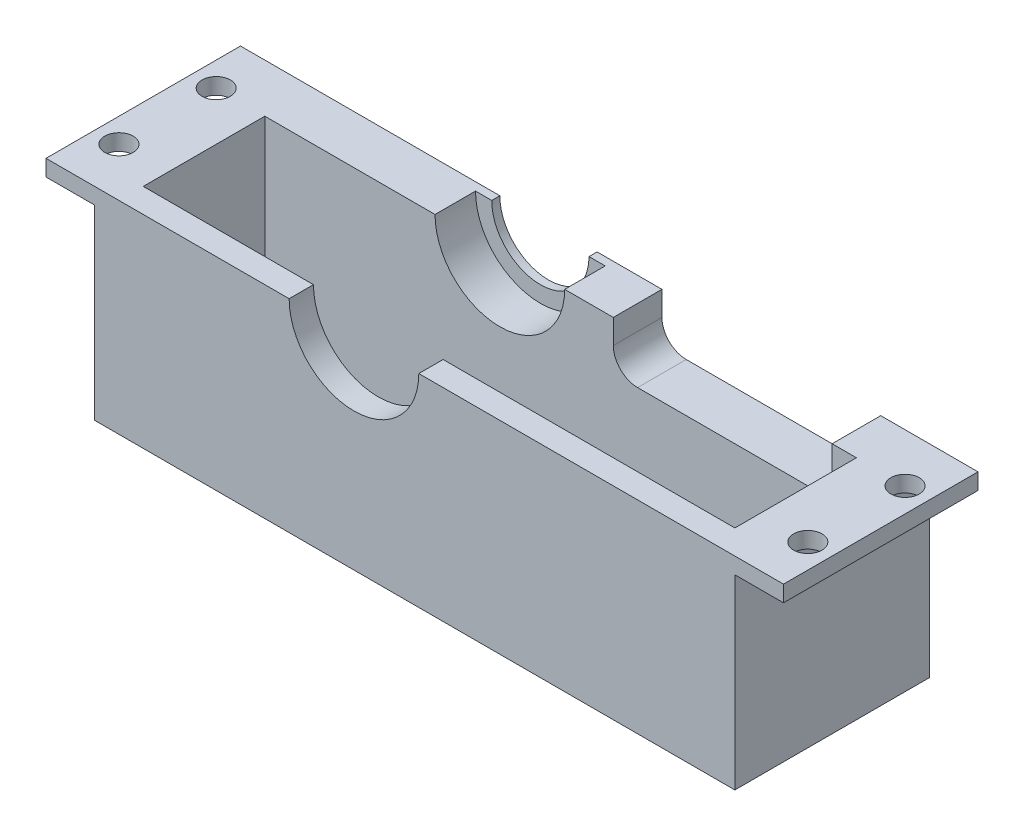
ISO-10303-21;
HEADER;
FILE_DESCRIPTION(('STEP AP214'),'2;1');
FILE_NAME('part.step','',(''),(''),'','','');
FILE_SCHEMA(('AUTOMOTIVE_DESIGN { 1 0 10303 214 1 1 1 1 }'));
ENDSEC;
DATA;
#1=APPLICATION_CONTEXT('core data for automotive mechanical design processes');
#2=APPLICATION_PROTOCOL_DEFINITION('international standard','automotive_design',2000,#1);
#3=PRODUCT_CONTEXT('',#1,'mechanical');
#4=PRODUCT('Part','Part','',(#3));
#5=PRODUCT_RELATED_PRODUCT_CATEGORY('part','',(#4));
#6=PRODUCT_DEFINITION_FORMATION('','',#4);
#7=PRODUCT_DEFINITION_CONTEXT('part definition',#1,'design');
#8=PRODUCT_DEFINITION('design','',#6,#7);
#9=PRODUCT_DEFINITION_SHAPE('','',#8);
#10=(LENGTH_UNIT() NAMED_UNIT(*) SI_UNIT(.MILLI.,.METRE.));
#11=(NAMED_UNIT(*) PLANE_ANGLE_UNIT() SI_UNIT($,.RADIAN.));
#12=(NAMED_UNIT(*) SI_UNIT($,.STERADIAN.) SOLID_ANGLE_UNIT());
#13=UNCERTAINTY_MEASURE_WITH_UNIT(LENGTH_MEASURE(1.E-05),#10,'distance_accuracy_value','');
#14=(GEOMETRIC_REPRESENTATION_CONTEXT(3) GLOBAL_UNCERTAINTY_ASSIGNED_CONTEXT((#13)) GLOBAL_UNIT_ASSIGNED_CONTEXT((#10,
#11,#12)) REPRESENTATION_CONTEXT('',''));
#15=CARTESIAN_POINT('',(0.,0.,0.));
#16=DIRECTION('',(0.,0.,1.));
#17=DIRECTION('',(1.,0.,0.));
#18=AXIS2_PLACEMENT_3D('',#15,#16,#17);
#19=CARTESIAN_POINT('',(0.,0.,0.));
#20=DIRECTION('',(0.,0.,1.));
#21=DIRECTION('',(1.,0.,0.));
#22=AXIS2_PLACEMENT_3D('',#19,#20,#21);
#23=PLANE('',#22);
#24=DIRECTION('',(0.,1.,0.));
#25=VECTOR('',#24,1.);
#26=CARTESIAN_POINT('',(9.,0.,0.));
#27=LINE('',#26,#25);
#28=CARTESIAN_POINT('',(9.,0.,0.));
#29=VERTEX_POINT('',#28);
#30=CARTESIAN_POINT('',(9.,2.,0.));
#31=VERTEX_POINT('',#30);
#32=EDGE_CURVE('E321',#29,#31,#27,.T.);
#33=ORIENTED_EDGE('',*,*,#32,.T.);
#34=DIRECTION('',(-1.,0.,0.));
#35=VECTOR('',#34,1.);
#36=CARTESIAN_POINT('',(0.,2.,0.));
#37=LINE('',#36,#35);
#38=CARTESIAN_POINT('',(3.,2.,0.));
#39=VERTEX_POINT('',#38);
#40=EDGE_CURVE('E327',#31,#39,#37,.T.);
#41=ORIENTED_EDGE('',*,*,#40,.T.);
#42=DIRECTION('',(0.,-1.,0.));
#43=VECTOR('',#42,1.);
#44=CARTESIAN_POINT('',(3.,25.,0.));
#45=LINE('',#44,#43);
#46=CARTESIAN_POINT('',(3.,25.,0.));
#47=VERTEX_POINT('',#46);
#48=EDGE_CURVE('E389',#47,#39,#45,.T.);
#49=ORIENTED_EDGE('',*,*,#48,.F.);
#50=DIRECTION('',(1.,0.,0.));
#51=VECTOR('',#50,1.);
#52=CARTESIAN_POINT('',(0.,25.,0.));
#53=LINE('',#52,#51);
#54=CARTESIAN_POINT('',(24.,25.,0.));
#55=VERTEX_POINT('',#54);
#56=EDGE_CURVE('E420',#47,#55,#53,.T.);
#57=ORIENTED_EDGE('',*,*,#56,.T.);
#58=CARTESIAN_POINT('',(32.,25.,0.));
#59=DIRECTION('',(0.,0.,1.));
#60=DIRECTION('',(1.,0.,0.));
#61=AXIS2_PLACEMENT_3D('',#58,#59,#60);
#62=CIRCLE('',#61,8.);
#63=CARTESIAN_POINT('',(40.,25.,0.));
#64=VERTEX_POINT('',#63);
#65=EDGE_CURVE('E401',#55,#64,#62,.T.);
#66=ORIENTED_EDGE('',*,*,#65,.T.);
#67=DIRECTION('',(-1.,0.,0.));
#68=VECTOR('',#67,1.);
#69=CARTESIAN_POINT('',(0.,25.,0.));
#70=LINE('',#69,#68);
#71=CARTESIAN_POINT('',(76.,25.,0.));
#72=VERTEX_POINT('',#71);
#73=EDGE_CURVE('E406',#72,#64,#70,.T.);
#74=ORIENTED_EDGE('',*,*,#73,.F.);
#75=DIRECTION('',(0.,1.,0.));
#76=VECTOR('',#75,1.);
#77=CARTESIAN_POINT('',(76.,25.,0.));
#78=LINE('',#77,#76);
#79=CARTESIAN_POINT('',(76.,2.,0.));
#80=VERTEX_POINT('',#79);
#81=EDGE_CURVE('E392',#80,#72,#78,.T.);
#82=ORIENTED_EDGE('',*,*,#81,.F.);
#83=DIRECTION('',(-1.,0.,0.));
#84=VECTOR('',#83,1.);
#85=CARTESIAN_POINT('',(0.,2.,0.));
#86=LINE('',#85,#84);
#87=CARTESIAN_POINT('',(70.,2.,0.));
#88=VERTEX_POINT('',#87);
#89=EDGE_CURVE('E348',#80,#88,#86,.T.);
#90=ORIENTED_EDGE('',*,*,#89,.T.);
#91=DIRECTION('',(0.,-1.,0.));
#92=VECTOR('',#91,1.);
#93=CARTESIAN_POINT('',(70.,0.,0.));
#94=LINE('',#93,#92);
#95=CARTESIAN_POINT('',(70.,0.,0.));
#96=VERTEX_POINT('',#95);
#97=EDGE_CURVE('E342',#88,#96,#94,.T.);
#98=ORIENTED_EDGE('',*,*,#97,.T.);
#99=DIRECTION('',(-1.,0.,0.));
#100=VECTOR('',#99,1.);
#101=CARTESIAN_POINT('',(0.,0.,0.));
#102=LINE('',#101,#100);
#103=EDGE_CURVE('E422',#96,#29,#102,.T.);
#104=ORIENTED_EDGE('',*,*,#103,.T.);
#105=EDGE_LOOP('',(#33,#41,#49,#57,#66,#74,#82,#90,#98,#104));
#106=FACE_BOUND('',#105,.T.);
#107=ADVANCED_FACE('F38',(#106),#23,.F.);
#108=CARTESIAN_POINT('',(32.,25.,3.));
#109=DIRECTION('',(0.,0.,-1.));
#110=DIRECTION('',(-1.,0.,0.));
#111=AXIS2_PLACEMENT_3D('',#108,#109,#110);
#112=CYLINDRICAL_SURFACE('',#111,8.);
#113=ORIENTED_EDGE('',*,*,#65,.F.);
#114=DIRECTION('',(0.,0.,-1.));
#115=VECTOR('',#114,1.);
#116=CARTESIAN_POINT('',(24.,25.,3.));
#117=LINE('',#116,#115);
#118=CARTESIAN_POINT('',(24.,25.,3.));
#119=VERTEX_POINT('',#118);
#120=EDGE_CURVE('E433',#119,#55,#117,.T.);
#121=ORIENTED_EDGE('',*,*,#120,.F.);
#122=CARTESIAN_POINT('',(32.,25.,3.));
#123=DIRECTION('',(0.,0.,1.));
#124=DIRECTION('',(1.,0.,0.));
#125=AXIS2_PLACEMENT_3D('',#122,#123,#124);
#126=CIRCLE('',#125,8.);
#127=CARTESIAN_POINT('',(40.,25.,3.));
#128=VERTEX_POINT('',#127);
#129=EDGE_CURVE('E402',#119,#128,#126,.T.);
#130=ORIENTED_EDGE('',*,*,#129,.T.);
#131=DIRECTION('',(0.,0.,-1.));
#132=VECTOR('',#131,1.);
#133=CARTESIAN_POINT('',(40.,25.,3.));
#134=LINE('',#133,#132);
#135=EDGE_CURVE('E417',#128,#64,#134,.T.);
#136=ORIENTED_EDGE('',*,*,#135,.T.);
#137=EDGE_LOOP('',(#113,#121,#130,#136));
#138=FACE_BOUND('',#137,.T.);
#139=ADVANCED_FACE('F526',(#138),#112,.F.);
#140=CARTESIAN_POINT('',(0.,25.,3.));
#141=DIRECTION('',(0.,1.,0.));
#142=DIRECTION('',(-1.,0.,0.));
#143=AXIS2_PLACEMENT_3D('',#140,#141,#142);
#144=PLANE('',#143);
#145=CARTESIAN_POINT('',(-2.99999999999999,25.,-3.));
#146=DIRECTION('',(0.,1.,0.));
#147=DIRECTION('',(0.,0.,-1.));
#148=AXIS2_PLACEMENT_3D('',#145,#146,#147);
#149=CIRCLE('',#148,1.74999999999998);
#150=CARTESIAN_POINT('',(-2.99999999999999,25.,-4.74999999999998));
#151=VERTEX_POINT('',#150);
#152=EDGE_CURVE('E1070',#151,#151,#149,.T.);
#153=ORIENTED_EDGE('',*,*,#152,.F.);
#154=EDGE_LOOP('',(#153));
#155=FACE_BOUND('',#154,.T.);
#156=CARTESIAN_POINT('',(-2.99999999999999,25.,-15.));
#157=DIRECTION('',(0.,1.,0.));
#158=DIRECTION('',(0.,0.,-1.));
#159=AXIS2_PLACEMENT_3D('',#156,#157,#158);
#160=CIRCLE('',#159,1.74999999999998);
#161=CARTESIAN_POINT('',(-2.99999999999999,25.,-16.75));
#162=VERTEX_POINT('',#161);
#163=EDGE_CURVE('E1067',#162,#162,#160,.T.);
#164=ORIENTED_EDGE('',*,*,#163,.F.);
#165=EDGE_LOOP('',(#164));
#166=FACE_BOUND('',#165,.T.);
#167=ORIENTED_EDGE('',*,*,#56,.F.);
#168=DIRECTION('',(0.,0.,1.));
#169=VECTOR('',#168,1.);
#170=CARTESIAN_POINT('',(3.,25.,-15.));
#171=LINE('',#170,#169);
#172=CARTESIAN_POINT('',(3.,25.,-15.));
#173=VERTEX_POINT('',#172);
#174=EDGE_CURVE('E385',#173,#47,#171,.T.);
#175=ORIENTED_EDGE('',*,*,#174,.F.);
#176=DIRECTION('',(1.,0.,0.));
#177=VECTOR('',#176,1.);
#178=CARTESIAN_POINT('',(0.,25.,-15.));
#179=LINE('',#178,#177);
#180=CARTESIAN_POINT('',(24.,25.,-15.));
#181=VERTEX_POINT('',#180);
#182=EDGE_CURVE('E362',#173,#181,#179,.T.);
#183=ORIENTED_EDGE('',*,*,#182,.T.);
#184=DIRECTION('',(0.,0.,1.));
#185=VECTOR('',#184,1.);
#186=CARTESIAN_POINT('',(24.,25.,-20.));
#187=LINE('',#186,#185);
#188=CARTESIAN_POINT('',(24.,25.,-20.));
#189=VERTEX_POINT('',#188);
#190=EDGE_CURVE('E382',#189,#181,#187,.T.);
#191=ORIENTED_EDGE('',*,*,#190,.F.);
#192=DIRECTION('',(1.,0.,0.));
#193=VECTOR('',#192,1.);
#194=CARTESIAN_POINT('',(0.,25.,-20.));
#195=LINE('',#194,#193);
#196=CARTESIAN_POINT('',(26.,25.,-20.));
#197=VERTEX_POINT('',#196);
#198=EDGE_CURVE('E274',#189,#197,#195,.T.);
#199=ORIENTED_EDGE('',*,*,#198,.T.);
#200=DIRECTION('',(0.,0.,1.));
#201=VECTOR('',#200,1.);
#202=CARTESIAN_POINT('',(26.,25.,-21.));
#203=LINE('',#202,#201);
#204=CARTESIAN_POINT('',(26.,25.,-21.));
#205=VERTEX_POINT('',#204);
#206=EDGE_CURVE('E306',#205,#197,#203,.T.);
#207=ORIENTED_EDGE('',*,*,#206,.F.);
#208=DIRECTION('',(1.,0.,0.));
#209=VECTOR('',#208,1.);
#210=CARTESIAN_POINT('',(0.,25.,-21.));
#211=LINE('',#210,#209);
#212=CARTESIAN_POINT('',(-6.,25.,-21.));
#213=VERTEX_POINT('',#212);
#214=EDGE_CURVE('E279',#213,#205,#211,.T.);
#215=ORIENTED_EDGE('',*,*,#214,.F.);
#216=DIRECTION('',(0.,0.,-1.));
#217=VECTOR('',#216,1.);
#218=CARTESIAN_POINT('',(-6.,25.,-21.));
#219=LINE('',#218,#217);
#220=CARTESIAN_POINT('',(-6.,25.,3.));
#221=VERTEX_POINT('',#220);
#222=EDGE_CURVE('E241',#221,#213,#219,.T.);
#223=ORIENTED_EDGE('',*,*,#222,.F.);
#224=DIRECTION('',(1.,0.,0.));
#225=VECTOR('',#224,1.);
#226=CARTESIAN_POINT('',(0.,25.,3.));
#227=LINE('',#226,#225);
#228=EDGE_CURVE('E405',#221,#119,#227,.T.);
#229=ORIENTED_EDGE('',*,*,#228,.T.);
#230=ORIENTED_EDGE('',*,*,#120,.T.);
#231=EDGE_LOOP('',(#167,#175,#183,#191,#199,#207,#215,#223,#229,#230));
#232=FACE_BOUND('',#231,.T.);
#233=ADVANCED_FACE('F509',(#155,#166,#232),#144,.T.);
#234=CARTESIAN_POINT('',(0.,0.,3.));
#235=DIRECTION('',(-1.,0.,0.));
#236=DIRECTION('',(0.,0.,1.));
#237=AXIS2_PLACEMENT_3D('',#234,#235,#236);
#238=PLANE('',#237);
#239=DIRECTION('',(0.,0.,1.));
#240=VECTOR('',#239,1.);
#241=CARTESIAN_POINT('',(0.,23.,-21.));
#242=LINE('',#241,#240);
#243=CARTESIAN_POINT('',(0.,23.,-21.));
#244=VERTEX_POINT('',#243);
#245=CARTESIAN_POINT('',(0.,23.,3.));
#246=VERTEX_POINT('',#245);
#247=EDGE_CURVE('E243',#244,#246,#242,.T.);
#248=ORIENTED_EDGE('',*,*,#247,.F.);
#249=DIRECTION('',(0.,1.,0.));
#250=VECTOR('',#249,1.);
#251=CARTESIAN_POINT('',(0.,0.,-21.));
#252=LINE('',#251,#250);
#253=CARTESIAN_POINT('',(0.,0.,-21.));
#254=VERTEX_POINT('',#253);
#255=EDGE_CURVE('E249',#254,#244,#252,.T.);
#256=ORIENTED_EDGE('',*,*,#255,.F.);
#257=DIRECTION('',(0.,0.,-1.));
#258=VECTOR('',#257,1.);
#259=CARTESIAN_POINT('',(0.,0.,3.));
#260=LINE('',#259,#258);
#261=CARTESIAN_POINT('',(0.,0.,3.));
#262=VERTEX_POINT('',#261);
#263=EDGE_CURVE('E431',#262,#254,#260,.T.);
#264=ORIENTED_EDGE('',*,*,#263,.F.);
#265=DIRECTION('',(0.,1.,0.));
#266=VECTOR('',#265,1.);
#267=CARTESIAN_POINT('',(0.,0.,3.));
#268=LINE('',#267,#266);
#269=EDGE_CURVE('E409',#262,#246,#268,.T.);
#270=ORIENTED_EDGE('',*,*,#269,.T.);
#271=EDGE_LOOP('',(#248,#256,#264,#270));
#272=FACE_BOUND('',#271,.T.);
#273=ADVANCED_FACE('F568',(#272),#238,.T.);
#274=CARTESIAN_POINT('',(0.,0.,3.));
#275=DIRECTION('',(0.,-1.,0.));
#276=DIRECTION('',(1.,0.,0.));
#277=AXIS2_PLACEMENT_3D('',#274,#275,#276);
#278=PLANE('',#277);
#279=CARTESIAN_POINT('',(6.00000000000002,0.,-4.));
#280=DIRECTION('',(0.,1.,0.));
#281=DIRECTION('',(0.,0.,-1.));
#282=AXIS2_PLACEMENT_3D('',#279,#280,#281);
#283=CIRCLE('',#282,1.75);
#284=CARTESIAN_POINT('',(6.00000000000002,0.,-5.75));
#285=VERTEX_POINT('',#284);
#286=EDGE_CURVE('E1061',#285,#285,#283,.T.);
#287=ORIENTED_EDGE('',*,*,#286,.T.);
#288=EDGE_LOOP('',(#287));
#289=FACE_BOUND('',#288,.T.);
#290=CARTESIAN_POINT('',(73.,0.,-4.));
#291=DIRECTION('',(0.,1.,0.));
#292=DIRECTION('',(0.,0.,1.));
#293=AXIS2_PLACEMENT_3D('',#290,#291,#292);
#294=CIRCLE('',#293,1.75);
#295=CARTESIAN_POINT('',(73.,0.,-2.25));
#296=VERTEX_POINT('',#295);
#297=EDGE_CURVE('E1051',#296,#296,#294,.T.);
#298=ORIENTED_EDGE('',*,*,#297,.T.);
#299=EDGE_LOOP('',(#298));
#300=FACE_BOUND('',#299,.T.);
#301=CARTESIAN_POINT('',(6.00000000000002,0.,-11.));
#302=DIRECTION('',(0.,1.,0.));
#303=DIRECTION('',(0.,0.,-1.));
#304=AXIS2_PLACEMENT_3D('',#301,#302,#303);
#305=CIRCLE('',#304,1.75);
#306=CARTESIAN_POINT('',(6.00000000000002,0.,-12.75));
#307=VERTEX_POINT('',#306);
#308=EDGE_CURVE('E1064',#307,#307,#305,.T.);
#309=ORIENTED_EDGE('',*,*,#308,.T.);
#310=EDGE_LOOP('',(#309));
#311=FACE_BOUND('',#310,.T.);
#312=CARTESIAN_POINT('',(73.,0.,-11.));
#313=DIRECTION('',(0.,1.,0.));
#314=DIRECTION('',(0.,0.,1.));
#315=AXIS2_PLACEMENT_3D('',#312,#313,#314);
#316=CIRCLE('',#315,1.75);
#317=CARTESIAN_POINT('',(73.,0.,-9.25000000000001));
#318=VERTEX_POINT('',#317);
#319=EDGE_CURVE('E441',#318,#318,#316,.T.);
#320=ORIENTED_EDGE('',*,*,#319,.T.);
#321=EDGE_LOOP('',(#320));
#322=FACE_BOUND('',#321,.T.);
#323=DIRECTION('',(0.,0.,1.));
#324=VECTOR('',#323,1.);
#325=CARTESIAN_POINT('',(9.,0.,-20.));
#326=LINE('',#325,#324);
#327=CARTESIAN_POINT('',(8.99999999999999,0.,-15.));
#328=VERTEX_POINT('',#327);
#329=EDGE_CURVE('E310',#328,#29,#326,.T.);
#330=ORIENTED_EDGE('',*,*,#329,.T.);
#331=ORIENTED_EDGE('',*,*,#103,.F.);
#332=DIRECTION('',(0.,0.,-1.));
#333=VECTOR('',#332,1.);
#334=CARTESIAN_POINT('',(70.,0.,3.));
#335=LINE('',#334,#333);
#336=CARTESIAN_POINT('',(70.,0.,-15.));
#337=VERTEX_POINT('',#336);
#338=EDGE_CURVE('E331',#96,#337,#335,.T.);
#339=ORIENTED_EDGE('',*,*,#338,.T.);
#340=DIRECTION('',(-1.,0.,0.));
#341=VECTOR('',#340,1.);
#342=CARTESIAN_POINT('',(79.,0.,-15.));
#343=LINE('',#342,#341);
#344=EDGE_CURVE('E359',#337,#328,#343,.T.);
#345=ORIENTED_EDGE('',*,*,#344,.T.);
#346=EDGE_LOOP('',(#330,#331,#339,#345));
#347=FACE_BOUND('',#346,.T.);
#348=ORIENTED_EDGE('',*,*,#263,.T.);
#349=DIRECTION('',(-1.,0.,0.));
#350=VECTOR('',#349,1.);
#351=CARTESIAN_POINT('',(79.,0.,-21.));
#352=LINE('',#351,#350);
#353=CARTESIAN_POINT('',(79.,0.,-21.));
#354=VERTEX_POINT('',#353);
#355=EDGE_CURVE('E275',#354,#254,#352,.T.);
#356=ORIENTED_EDGE('',*,*,#355,.F.);
#357=DIRECTION('',(0.,0.,-1.));
#358=VECTOR('',#357,1.);
#359=CARTESIAN_POINT('',(79.,0.,3.));
#360=LINE('',#359,#358);
#361=CARTESIAN_POINT('',(79.,0.,3.));
#362=VERTEX_POINT('',#361);
#363=EDGE_CURVE('E428',#362,#354,#360,.T.);
#364=ORIENTED_EDGE('',*,*,#363,.F.);
#365=DIRECTION('',(-1.,0.,0.));
#366=VECTOR('',#365,1.);
#367=CARTESIAN_POINT('',(0.,0.,3.));
#368=LINE('',#367,#366);
#369=EDGE_CURVE('E411',#362,#262,#368,.T.);
#370=ORIENTED_EDGE('',*,*,#369,.T.);
#371=EDGE_LOOP('',(#348,#356,#364,#370));
#372=FACE_BOUND('',#371,.T.);
#373=ADVANCED_FACE('F539',(#289,#300,#311,#322,#347,#372),#278,.T.);
#374=CARTESIAN_POINT('',(79.,0.,3.));
#375=DIRECTION('',(1.,0.,0.));
#376=DIRECTION('',(0.,0.,-1.));
#377=AXIS2_PLACEMENT_3D('',#374,#375,#376);
#378=PLANE('',#377);
#379=DIRECTION('',(0.,0.,-1.));
#380=VECTOR('',#379,1.);
#381=CARTESIAN_POINT('',(79.,23.,3.));
#382=LINE('',#381,#380);
#383=CARTESIAN_POINT('',(79.,23.,3.));
#384=VERTEX_POINT('',#383);
#385=CARTESIAN_POINT('',(79.,23.,-21.));
#386=VERTEX_POINT('',#385);
#387=EDGE_CURVE('E250',#384,#386,#382,.T.);
#388=ORIENTED_EDGE('',*,*,#387,.F.);
#389=DIRECTION('',(0.,-1.,0.));
#390=VECTOR('',#389,1.);
#391=CARTESIAN_POINT('',(79.,0.,3.));
#392=LINE('',#391,#390);
#393=EDGE_CURVE('E413',#384,#362,#392,.T.);
#394=ORIENTED_EDGE('',*,*,#393,.T.);
#395=ORIENTED_EDGE('',*,*,#363,.T.);
#396=DIRECTION('',(0.,-1.,0.));
#397=VECTOR('',#396,1.);
#398=CARTESIAN_POINT('',(79.,0.,-21.));
#399=LINE('',#398,#397);
#400=EDGE_CURVE('E295',#386,#354,#399,.T.);
#401=ORIENTED_EDGE('',*,*,#400,.F.);
#402=EDGE_LOOP('',(#388,#394,#395,#401));
#403=FACE_BOUND('',#402,.T.);
#404=ADVANCED_FACE('F565',(#403),#378,.T.);
#405=CARTESIAN_POINT('',(0.,25.,3.));
#406=DIRECTION('',(0.,-1.,0.));
#407=DIRECTION('',(1.,0.,0.));
#408=AXIS2_PLACEMENT_3D('',#405,#406,#407);
#409=PLANE('',#408);
#410=CARTESIAN_POINT('',(82.,25.,-3.));
#411=DIRECTION('',(0.,1.,0.));
#412=DIRECTION('',(0.,0.,1.));
#413=AXIS2_PLACEMENT_3D('',#410,#411,#412);
#414=CIRCLE('',#413,1.74999999999998);
#415=CARTESIAN_POINT('',(82.,25.,-1.25000000000002));
#416=VERTEX_POINT('',#415);
#417=EDGE_CURVE('E1058',#416,#416,#414,.T.);
#418=ORIENTED_EDGE('',*,*,#417,.F.);
#419=EDGE_LOOP('',(#418));
#420=FACE_BOUND('',#419,.T.);
#421=CARTESIAN_POINT('',(82.,25.,-15.));
#422=DIRECTION('',(0.,1.,0.));
#423=DIRECTION('',(0.,0.,1.));
#424=AXIS2_PLACEMENT_3D('',#421,#422,#423);
#425=CIRCLE('',#424,1.74999999999998);
#426=CARTESIAN_POINT('',(82.,25.,-13.25));
#427=VERTEX_POINT('',#426);
#428=EDGE_CURVE('E1053',#427,#427,#425,.T.);
#429=ORIENTED_EDGE('',*,*,#428,.F.);
#430=EDGE_LOOP('',(#429));
#431=FACE_BOUND('',#430,.T.);
#432=DIRECTION('',(-1.,0.,0.));
#433=VECTOR('',#432,1.);
#434=CARTESIAN_POINT('',(0.,25.,3.));
#435=LINE('',#434,#433);
#436=CARTESIAN_POINT('',(85.,25.,3.));
#437=VERTEX_POINT('',#436);
#438=EDGE_CURVE('E415',#437,#128,#435,.T.);
#439=ORIENTED_EDGE('',*,*,#438,.F.);
#440=DIRECTION('',(0.,0.,1.));
#441=VECTOR('',#440,1.);
#442=CARTESIAN_POINT('',(85.,25.,3.));
#443=LINE('',#442,#441);
#444=CARTESIAN_POINT('',(85.,25.,-21.));
#445=VERTEX_POINT('',#444);
#446=EDGE_CURVE('E265',#445,#437,#443,.T.);
#447=ORIENTED_EDGE('',*,*,#446,.F.);
#448=DIRECTION('',(1.,0.,0.));
#449=VECTOR('',#448,1.);
#450=CARTESIAN_POINT('',(79.,25.,-21.));
#451=LINE('',#450,#449);
#452=CARTESIAN_POINT('',(73.,25.,-21.));
#453=VERTEX_POINT('',#452);
#454=EDGE_CURVE('E293',#453,#445,#451,.T.);
#455=ORIENTED_EDGE('',*,*,#454,.F.);
#456=DIRECTION('',(0.,0.,1.));
#457=VECTOR('',#456,1.);
#458=CARTESIAN_POINT('',(73.,25.,-20.));
#459=LINE('',#458,#457);
#460=CARTESIAN_POINT('',(73.,25.,-15.));
#461=VERTEX_POINT('',#460);
#462=EDGE_CURVE('E355',#453,#461,#459,.T.);
#463=ORIENTED_EDGE('',*,*,#462,.T.);
#464=DIRECTION('',(1.,0.,0.));
#465=VECTOR('',#464,1.);
#466=CARTESIAN_POINT('',(79.,25.,-15.));
#467=LINE('',#466,#465);
#468=CARTESIAN_POINT('',(76.,25.,-15.));
#469=VERTEX_POINT('',#468);
#470=EDGE_CURVE('E351',#461,#469,#467,.T.);
#471=ORIENTED_EDGE('',*,*,#470,.T.);
#472=DIRECTION('',(0.,0.,1.));
#473=VECTOR('',#472,1.);
#474=CARTESIAN_POINT('',(76.,25.,-15.));
#475=LINE('',#474,#473);
#476=EDGE_CURVE('E397',#469,#72,#475,.T.);
#477=ORIENTED_EDGE('',*,*,#476,.T.);
#478=ORIENTED_EDGE('',*,*,#73,.T.);
#479=ORIENTED_EDGE('',*,*,#135,.F.);
#480=EDGE_LOOP('',(#439,#447,#455,#463,#471,#477,#478,#479));
#481=FACE_BOUND('',#480,.T.);
#482=ADVANCED_FACE('F553',(#420,#431,#481),#409,.F.);
#483=CARTESIAN_POINT('',(0.,0.,3.));
#484=DIRECTION('',(0.,0.,1.));
#485=DIRECTION('',(1.,0.,0.));
#486=AXIS2_PLACEMENT_3D('',#483,#484,#485);
#487=PLANE('',#486);
#488=ORIENTED_EDGE('',*,*,#269,.F.);
#489=ORIENTED_EDGE('',*,*,#369,.F.);
#490=ORIENTED_EDGE('',*,*,#393,.F.);
#491=DIRECTION('',(-1.,0.,0.));
#492=VECTOR('',#491,1.);
#493=CARTESIAN_POINT('',(85.,23.,3.));
#494=LINE('',#493,#492);
#495=CARTESIAN_POINT('',(85.,23.,3.));
#496=VERTEX_POINT('',#495);
#497=EDGE_CURVE('E271',#496,#384,#494,.T.);
#498=ORIENTED_EDGE('',*,*,#497,.F.);
#499=DIRECTION('',(0.,-1.,0.));
#500=VECTOR('',#499,1.);
#501=CARTESIAN_POINT('',(85.,25.,3.));
#502=LINE('',#501,#500);
#503=EDGE_CURVE('E253',#437,#496,#502,.T.);
#504=ORIENTED_EDGE('',*,*,#503,.F.);
#505=ORIENTED_EDGE('',*,*,#438,.T.);
#506=ORIENTED_EDGE('',*,*,#129,.F.);
#507=ORIENTED_EDGE('',*,*,#228,.F.);
#508=DIRECTION('',(0.,1.,0.));
#509=VECTOR('',#508,1.);
#510=CARTESIAN_POINT('',(-6.,25.,3.));
#511=LINE('',#510,#509);
#512=CARTESIAN_POINT('',(-6.,23.,3.));
#513=VERTEX_POINT('',#512);
#514=EDGE_CURVE('E234',#513,#221,#511,.T.);
#515=ORIENTED_EDGE('',*,*,#514,.F.);
#516=DIRECTION('',(1.,0.,0.));
#517=VECTOR('',#516,1.);
#518=CARTESIAN_POINT('',(-6.,23.,3.));
#519=LINE('',#518,#517);
#520=EDGE_CURVE('E230',#513,#246,#519,.T.);
#521=ORIENTED_EDGE('',*,*,#520,.T.);
#522=EDGE_LOOP('',(#488,#489,#490,#498,#504,#505,#506,#507,#515,#521));
#523=FACE_BOUND('',#522,.T.);
#524=ADVANCED_FACE('F519',(#523),#487,.T.);
#525=CARTESIAN_POINT('',(76.,25.,-15.));
#526=DIRECTION('',(1.,0.,0.));
#527=DIRECTION('',(0.,0.,-1.));
#528=AXIS2_PLACEMENT_3D('',#525,#526,#527);
#529=PLANE('',#528);
#530=DIRECTION('',(0.,1.,0.));
#531=VECTOR('',#530,1.);
#532=CARTESIAN_POINT('',(76.,25.,-15.));
#533=LINE('',#532,#531);
#534=CARTESIAN_POINT('',(76.,2.,-15.));
#535=VERTEX_POINT('',#534);
#536=EDGE_CURVE('E395',#535,#469,#533,.T.);
#537=ORIENTED_EDGE('',*,*,#536,.F.);
#538=DIRECTION('',(0.,0.,1.));
#539=VECTOR('',#538,1.);
#540=CARTESIAN_POINT('',(76.,2.,3.));
#541=LINE('',#540,#539);
#542=EDGE_CURVE('E330',#535,#80,#541,.T.);
#543=ORIENTED_EDGE('',*,*,#542,.T.);
#544=ORIENTED_EDGE('',*,*,#81,.T.);
#545=ORIENTED_EDGE('',*,*,#476,.F.);
#546=EDGE_LOOP('',(#537,#543,#544,#545));
#547=FACE_BOUND('',#546,.T.);
#548=ADVANCED_FACE('F549',(#547),#529,.F.);
#549=CARTESIAN_POINT('',(3.,25.,-15.));
#550=DIRECTION('',(-1.,0.,0.));
#551=DIRECTION('',(0.,-1.,0.));
#552=AXIS2_PLACEMENT_3D('',#549,#550,#551);
#553=PLANE('',#552);
#554=ORIENTED_EDGE('',*,*,#48,.T.);
#555=DIRECTION('',(0.,0.,-1.));
#556=VECTOR('',#555,1.);
#557=CARTESIAN_POINT('',(3.,2.,-20.));
#558=LINE('',#557,#556);
#559=CARTESIAN_POINT('',(3.,2.,-15.));
#560=VERTEX_POINT('',#559);
#561=EDGE_CURVE('E309',#39,#560,#558,.T.);
#562=ORIENTED_EDGE('',*,*,#561,.T.);
#563=DIRECTION('',(0.,-1.,0.));
#564=VECTOR('',#563,1.);
#565=CARTESIAN_POINT('',(3.,25.,-15.));
#566=LINE('',#565,#564);
#567=EDGE_CURVE('E388',#173,#560,#566,.T.);
#568=ORIENTED_EDGE('',*,*,#567,.F.);
#569=ORIENTED_EDGE('',*,*,#174,.T.);
#570=EDGE_LOOP('',(#554,#562,#568,#569));
#571=FACE_BOUND('',#570,.T.);
#572=ADVANCED_FACE('F530',(#571),#553,.F.);
#573=CARTESIAN_POINT('',(32.,25.,-15.));
#574=DIRECTION('',(0.,0.,-1.));
#575=DIRECTION('',(-1.,0.,0.));
#576=AXIS2_PLACEMENT_3D('',#573,#574,#575);
#577=PLANE('',#576);
#578=ORIENTED_EDGE('',*,*,#567,.T.);
#579=DIRECTION('',(1.,0.,0.));
#580=VECTOR('',#579,1.);
#581=CARTESIAN_POINT('',(32.,2.00000000000001,-15.));
#582=LINE('',#581,#580);
#583=CARTESIAN_POINT('',(9.,2.,-15.));
#584=VERTEX_POINT('',#583);
#585=EDGE_CURVE('E324',#560,#584,#582,.T.);
#586=ORIENTED_EDGE('',*,*,#585,.T.);
#587=DIRECTION('',(0.,-1.,0.));
#588=VECTOR('',#587,1.);
#589=CARTESIAN_POINT('',(9.,25.,-15.));
#590=LINE('',#589,#588);
#591=EDGE_CURVE('E316',#584,#328,#590,.T.);
#592=ORIENTED_EDGE('',*,*,#591,.T.);
#593=ORIENTED_EDGE('',*,*,#344,.F.);
#594=DIRECTION('',(0.,1.,0.));
#595=VECTOR('',#594,1.);
#596=CARTESIAN_POINT('',(70.,25.,-15.));
#597=LINE('',#596,#595);
#598=CARTESIAN_POINT('',(70.,2.,-15.));
#599=VERTEX_POINT('',#598);
#600=EDGE_CURVE('E337',#337,#599,#597,.T.);
#601=ORIENTED_EDGE('',*,*,#600,.T.);
#602=DIRECTION('',(1.,0.,0.));
#603=VECTOR('',#602,1.);
#604=CARTESIAN_POINT('',(32.,2.,-15.));
#605=LINE('',#604,#603);
#606=EDGE_CURVE('E345',#599,#535,#605,.T.);
#607=ORIENTED_EDGE('',*,*,#606,.T.);
#608=ORIENTED_EDGE('',*,*,#536,.T.);
#609=ORIENTED_EDGE('',*,*,#470,.F.);
#610=DIRECTION('',(0.,1.,0.));
#611=VECTOR('',#610,1.);
#612=CARTESIAN_POINT('',(73.,25.,-15.));
#613=LINE('',#612,#611);
#614=CARTESIAN_POINT('',(73.,22.,-15.));
#615=VERTEX_POINT('',#614);
#616=EDGE_CURVE('E356',#615,#461,#613,.T.);
#617=ORIENTED_EDGE('',*,*,#616,.F.);
#618=CARTESIAN_POINT('',(70.,22.,-15.));
#619=DIRECTION('',(0.,0.,-1.));
#620=DIRECTION('',(-1.,0.,0.));
#621=AXIS2_PLACEMENT_3D('',#618,#619,#620);
#622=CIRCLE('',#621,3.);
#623=CARTESIAN_POINT('',(70.,19.,-15.));
#624=VERTEX_POINT('',#623);
#625=EDGE_CURVE('E470',#615,#624,#622,.T.);
#626=ORIENTED_EDGE('',*,*,#625,.T.);
#627=DIRECTION('',(1.,0.,0.));
#628=VECTOR('',#627,1.);
#629=CARTESIAN_POINT('',(73.,19.,-15.));
#630=LINE('',#629,#628);
#631=CARTESIAN_POINT('',(49.,19.,-15.));
#632=VERTEX_POINT('',#631);
#633=EDGE_CURVE('E370',#632,#624,#630,.T.);
#634=ORIENTED_EDGE('',*,*,#633,.F.);
#635=CARTESIAN_POINT('',(49.,22.,-15.));
#636=DIRECTION('',(0.,0.,-1.));
#637=DIRECTION('',(-1.,0.,0.));
#638=AXIS2_PLACEMENT_3D('',#635,#636,#637);
#639=CIRCLE('',#638,3.);
#640=CARTESIAN_POINT('',(46.,22.,-15.));
#641=VERTEX_POINT('',#640);
#642=EDGE_CURVE('E46',#632,#641,#639,.T.);
#643=ORIENTED_EDGE('',*,*,#642,.T.);
#644=DIRECTION('',(0.,-1.,0.));
#645=VECTOR('',#644,1.);
#646=CARTESIAN_POINT('',(46.,19.,-15.));
#647=LINE('',#646,#645);
#648=CARTESIAN_POINT('',(46.,25.,-15.));
#649=VERTEX_POINT('',#648);
#650=EDGE_CURVE('E368',#649,#641,#647,.T.);
#651=ORIENTED_EDGE('',*,*,#650,.F.);
#652=DIRECTION('',(1.,0.,0.));
#653=VECTOR('',#652,1.);
#654=CARTESIAN_POINT('',(46.,25.,-15.));
#655=LINE('',#654,#653);
#656=CARTESIAN_POINT('',(40.,25.,-15.));
#657=VERTEX_POINT('',#656);
#658=EDGE_CURVE('E366',#657,#649,#655,.T.);
#659=ORIENTED_EDGE('',*,*,#658,.F.);
#660=CARTESIAN_POINT('',(32.,25.,-15.));
#661=DIRECTION('',(0.,0.,1.));
#662=DIRECTION('',(-1.,0.,0.));
#663=AXIS2_PLACEMENT_3D('',#660,#661,#662);
#664=CIRCLE('',#663,8.);
#665=EDGE_CURVE('E364',#181,#657,#664,.T.);
#666=ORIENTED_EDGE('',*,*,#665,.F.);
#667=ORIENTED_EDGE('',*,*,#182,.F.);
#668=EDGE_LOOP('',(#578,#586,#592,#593,#601,#607,#608,#609,#617,#626,#634,#643,#651,#659,#666,#667));
#669=FACE_BOUND('',#668,.T.);
#670=ADVANCED_FACE('F485',(#669),#577,.F.);
#671=CARTESIAN_POINT('',(32.,25.,-20.));
#672=DIRECTION('',(0.,0.,1.));
#673=DIRECTION('',(1.,0.,0.));
#674=AXIS2_PLACEMENT_3D('',#671,#672,#673);
#675=CYLINDRICAL_SURFACE('',#674,8.);
#676=ORIENTED_EDGE('',*,*,#665,.T.);
#677=DIRECTION('',(0.,0.,1.));
#678=VECTOR('',#677,1.);
#679=CARTESIAN_POINT('',(40.,25.,-20.));
#680=LINE('',#679,#678);
#681=CARTESIAN_POINT('',(40.,25.,-20.));
#682=VERTEX_POINT('',#681);
#683=EDGE_CURVE('E379',#682,#657,#680,.T.);
#684=ORIENTED_EDGE('',*,*,#683,.F.);
#685=CARTESIAN_POINT('',(32.,25.,-20.));
#686=DIRECTION('',(0.,0.,1.));
#687=DIRECTION('',(-1.,0.,0.));
#688=AXIS2_PLACEMENT_3D('',#685,#686,#687);
#689=CIRCLE('',#688,8.);
#690=EDGE_CURVE('E352',#189,#682,#689,.T.);
#691=ORIENTED_EDGE('',*,*,#690,.F.);
#692=ORIENTED_EDGE('',*,*,#190,.T.);
#693=EDGE_LOOP('',(#676,#684,#691,#692));
#694=FACE_BOUND('',#693,.T.);
#695=ADVANCED_FACE('F501',(#694),#675,.F.);
#696=CARTESIAN_POINT('',(46.,25.,-20.));
#697=DIRECTION('',(0.,-1.,0.));
#698=DIRECTION('',(0.,0.,-1.));
#699=AXIS2_PLACEMENT_3D('',#696,#697,#698);
#700=PLANE('',#699);
#701=ORIENTED_EDGE('',*,*,#658,.T.);
#702=DIRECTION('',(0.,0.,1.));
#703=VECTOR('',#702,1.);
#704=CARTESIAN_POINT('',(46.,25.,-20.));
#705=LINE('',#704,#703);
#706=CARTESIAN_POINT('',(46.,25.,-21.));
#707=VERTEX_POINT('',#706);
#708=EDGE_CURVE('E376',#707,#649,#705,.T.);
#709=ORIENTED_EDGE('',*,*,#708,.F.);
#710=DIRECTION('',(1.,0.,0.));
#711=VECTOR('',#710,1.);
#712=CARTESIAN_POINT('',(40.,25.,-21.));
#713=LINE('',#712,#711);
#714=CARTESIAN_POINT('',(38.,25.,-21.));
#715=VERTEX_POINT('',#714);
#716=EDGE_CURVE('E283',#715,#707,#713,.T.);
#717=ORIENTED_EDGE('',*,*,#716,.F.);
#718=DIRECTION('',(0.,0.,1.));
#719=VECTOR('',#718,1.);
#720=CARTESIAN_POINT('',(38.,25.,-21.));
#721=LINE('',#720,#719);
#722=CARTESIAN_POINT('',(38.,25.,-20.));
#723=VERTEX_POINT('',#722);
#724=EDGE_CURVE('E297',#715,#723,#721,.T.);
#725=ORIENTED_EDGE('',*,*,#724,.T.);
#726=DIRECTION('',(1.,0.,0.));
#727=VECTOR('',#726,1.);
#728=CARTESIAN_POINT('',(46.,25.,-20.));
#729=LINE('',#728,#727);
#730=EDGE_CURVE('E277',#723,#682,#729,.T.);
#731=ORIENTED_EDGE('',*,*,#730,.T.);
#732=ORIENTED_EDGE('',*,*,#683,.T.);
#733=EDGE_LOOP('',(#701,#709,#717,#725,#731,#732));
#734=FACE_BOUND('',#733,.T.);
#735=ADVANCED_FACE('F498',(#734),#700,.F.);
#736=CARTESIAN_POINT('',(46.,19.,-20.));
#737=DIRECTION('',(-1.,0.,0.));
#738=DIRECTION('',(0.,0.,1.));
#739=AXIS2_PLACEMENT_3D('',#736,#737,#738);
#740=PLANE('',#739);
#741=ORIENTED_EDGE('',*,*,#650,.T.);
#742=DIRECTION('',(0.,0.,1.));
#743=VECTOR('',#742,1.);
#744=CARTESIAN_POINT('',(46.,22.,-21.));
#745=LINE('',#744,#743);
#746=CARTESIAN_POINT('',(46.,22.,-21.));
#747=VERTEX_POINT('',#746);
#748=EDGE_CURVE('E53',#641,#747,#745,.F.);
#749=ORIENTED_EDGE('',*,*,#748,.T.);
#750=DIRECTION('',(0.,-1.,0.));
#751=VECTOR('',#750,1.);
#752=CARTESIAN_POINT('',(46.,19.,-21.));
#753=LINE('',#752,#751);
#754=EDGE_CURVE('E286',#707,#747,#753,.T.);
#755=ORIENTED_EDGE('',*,*,#754,.F.);
#756=ORIENTED_EDGE('',*,*,#708,.T.);
#757=EDGE_LOOP('',(#741,#749,#755,#756));
#758=FACE_BOUND('',#757,.T.);
#759=ADVANCED_FACE('F493',(#758),#740,.F.);
#760=CARTESIAN_POINT('',(73.,19.,-20.));
#761=DIRECTION('',(0.,-1.,0.));
#762=DIRECTION('',(0.,0.,-1.));
#763=AXIS2_PLACEMENT_3D('',#760,#761,#762);
#764=PLANE('',#763);
#765=ORIENTED_EDGE('',*,*,#633,.T.);
#766=DIRECTION('',(0.,0.,1.));
#767=VECTOR('',#766,1.);
#768=CARTESIAN_POINT('',(70.,19.,-21.));
#769=LINE('',#768,#767);
#770=CARTESIAN_POINT('',(70.,19.,-21.));
#771=VERTEX_POINT('',#770);
#772=EDGE_CURVE('E467',#624,#771,#769,.F.);
#773=ORIENTED_EDGE('',*,*,#772,.T.);
#774=DIRECTION('',(1.,0.,0.));
#775=VECTOR('',#774,1.);
#776=CARTESIAN_POINT('',(73.,19.,-21.));
#777=LINE('',#776,#775);
#778=CARTESIAN_POINT('',(49.,19.,-21.));
#779=VERTEX_POINT('',#778);
#780=EDGE_CURVE('E288',#779,#771,#777,.T.);
#781=ORIENTED_EDGE('',*,*,#780,.F.);
#782=DIRECTION('',(0.,0.,1.));
#783=VECTOR('',#782,1.);
#784=CARTESIAN_POINT('',(49.,19.,-15.));
#785=LINE('',#784,#783);
#786=EDGE_CURVE('E464',#779,#632,#785,.T.);
#787=ORIENTED_EDGE('',*,*,#786,.T.);
#788=EDGE_LOOP('',(#765,#773,#781,#787));
#789=FACE_BOUND('',#788,.T.);
#790=ADVANCED_FACE('F488',(#789),#764,.F.);
#791=CARTESIAN_POINT('',(73.,25.,-20.));
#792=DIRECTION('',(1.,0.,0.));
#793=DIRECTION('',(0.,0.,-1.));
#794=AXIS2_PLACEMENT_3D('',#791,#792,#793);
#795=PLANE('',#794);
#796=DIRECTION('',(0.,1.,0.));
#797=VECTOR('',#796,1.);
#798=CARTESIAN_POINT('',(73.,25.,-21.));
#799=LINE('',#798,#797);
#800=CARTESIAN_POINT('',(73.,22.,-21.));
#801=VERTEX_POINT('',#800);
#802=EDGE_CURVE('E291',#801,#453,#799,.T.);
#803=ORIENTED_EDGE('',*,*,#802,.F.);
#804=DIRECTION('',(0.,0.,1.));
#805=VECTOR('',#804,1.);
#806=CARTESIAN_POINT('',(73.,22.,-15.));
#807=LINE('',#806,#805);
#808=EDGE_CURVE('E436',#801,#615,#807,.T.);
#809=ORIENTED_EDGE('',*,*,#808,.T.);
#810=ORIENTED_EDGE('',*,*,#616,.T.);
#811=ORIENTED_EDGE('',*,*,#462,.F.);
#812=EDGE_LOOP('',(#803,#809,#810,#811));
#813=FACE_BOUND('',#812,.T.);
#814=ADVANCED_FACE('F481',(#813),#795,.F.);
#815=CARTESIAN_POINT('',(70.,2.,3.));
#816=DIRECTION('',(0.,1.,0.));
#817=DIRECTION('',(0.,0.,1.));
#818=AXIS2_PLACEMENT_3D('',#815,#816,#817);
#819=PLANE('',#818);
#820=CARTESIAN_POINT('',(73.,2.,-4.));
#821=DIRECTION('',(0.,1.,0.));
#822=DIRECTION('',(0.,0.,1.));
#823=AXIS2_PLACEMENT_3D('',#820,#821,#822);
#824=CIRCLE('',#823,1.75);
#825=CARTESIAN_POINT('',(73.,2.,-2.25));
#826=VERTEX_POINT('',#825);
#827=EDGE_CURVE('E459',#826,#826,#824,.T.);
#828=ORIENTED_EDGE('',*,*,#827,.F.);
#829=EDGE_LOOP('',(#828));
#830=FACE_BOUND('',#829,.T.);
#831=CARTESIAN_POINT('',(73.,2.,-11.));
#832=DIRECTION('',(0.,1.,0.));
#833=DIRECTION('',(0.,0.,1.));
#834=AXIS2_PLACEMENT_3D('',#831,#832,#833);
#835=CIRCLE('',#834,1.75);
#836=CARTESIAN_POINT('',(73.,2.,-9.25000000000001));
#837=VERTEX_POINT('',#836);
#838=EDGE_CURVE('E456',#837,#837,#835,.T.);
#839=ORIENTED_EDGE('',*,*,#838,.F.);
#840=EDGE_LOOP('',(#839));
#841=FACE_BOUND('',#840,.T.);
#842=ORIENTED_EDGE('',*,*,#89,.F.);
#843=ORIENTED_EDGE('',*,*,#542,.F.);
#844=ORIENTED_EDGE('',*,*,#606,.F.);
#845=DIRECTION('',(0.,0.,1.));
#846=VECTOR('',#845,1.);
#847=CARTESIAN_POINT('',(70.,2.,3.));
#848=LINE('',#847,#846);
#849=EDGE_CURVE('E334',#599,#88,#848,.T.);
#850=ORIENTED_EDGE('',*,*,#849,.T.);
#851=EDGE_LOOP('',(#842,#843,#844,#850));
#852=FACE_BOUND('',#851,.T.);
#853=ADVANCED_FACE('F546',(#830,#841,#852),#819,.T.);
#854=CARTESIAN_POINT('',(70.,0.,0.));
#855=DIRECTION('',(-1.,0.,0.));
#856=DIRECTION('',(0.,0.,1.));
#857=AXIS2_PLACEMENT_3D('',#854,#855,#856);
#858=PLANE('',#857);
#859=ORIENTED_EDGE('',*,*,#97,.F.);
#860=ORIENTED_EDGE('',*,*,#849,.F.);
#861=ORIENTED_EDGE('',*,*,#600,.F.);
#862=ORIENTED_EDGE('',*,*,#338,.F.);
#863=EDGE_LOOP('',(#859,#860,#861,#862));
#864=FACE_BOUND('',#863,.T.);
#865=ADVANCED_FACE('F544',(#864),#858,.T.);
#866=CARTESIAN_POINT('',(9.,2.,-20.));
#867=DIRECTION('',(0.,1.,0.));
#868=DIRECTION('',(-1.,0.,0.));
#869=AXIS2_PLACEMENT_3D('',#866,#867,#868);
#870=PLANE('',#869);
#871=CARTESIAN_POINT('',(6.00000000000002,2.,-4.));
#872=DIRECTION('',(0.,1.,0.));
#873=DIRECTION('',(-1.,0.,0.));
#874=AXIS2_PLACEMENT_3D('',#871,#872,#873);
#875=CIRCLE('',#874,1.75);
#876=CARTESIAN_POINT('',(4.25000000000001,2.,-4.));
#877=VERTEX_POINT('',#876);
#878=EDGE_CURVE('E453',#877,#877,#875,.T.);
#879=ORIENTED_EDGE('',*,*,#878,.F.);
#880=EDGE_LOOP('',(#879));
#881=FACE_BOUND('',#880,.T.);
#882=CARTESIAN_POINT('',(6.00000000000002,2.,-11.));
#883=DIRECTION('',(0.,1.,0.));
#884=DIRECTION('',(-1.,0.,0.));
#885=AXIS2_PLACEMENT_3D('',#882,#883,#884);
#886=CIRCLE('',#885,1.75);
#887=CARTESIAN_POINT('',(4.25000000000001,2.,-11.));
#888=VERTEX_POINT('',#887);
#889=EDGE_CURVE('E450',#888,#888,#886,.T.);
#890=ORIENTED_EDGE('',*,*,#889,.F.);
#891=EDGE_LOOP('',(#890));
#892=FACE_BOUND('',#891,.T.);
#893=ORIENTED_EDGE('',*,*,#40,.F.);
#894=DIRECTION('',(0.,0.,-1.));
#895=VECTOR('',#894,1.);
#896=CARTESIAN_POINT('',(9.,2.,-20.));
#897=LINE('',#896,#895);
#898=EDGE_CURVE('E313',#31,#584,#897,.T.);
#899=ORIENTED_EDGE('',*,*,#898,.T.);
#900=ORIENTED_EDGE('',*,*,#585,.F.);
#901=ORIENTED_EDGE('',*,*,#561,.F.);
#902=EDGE_LOOP('',(#893,#899,#900,#901));
#903=FACE_BOUND('',#902,.T.);
#904=ADVANCED_FACE('F533',(#881,#892,#903),#870,.T.);
#905=CARTESIAN_POINT('',(9.,0.,0.));
#906=DIRECTION('',(1.,0.,0.));
#907=DIRECTION('',(0.,0.,-1.));
#908=AXIS2_PLACEMENT_3D('',#905,#906,#907);
#909=PLANE('',#908);
#910=ORIENTED_EDGE('',*,*,#32,.F.);
#911=ORIENTED_EDGE('',*,*,#329,.F.);
#912=ORIENTED_EDGE('',*,*,#591,.F.);
#913=ORIENTED_EDGE('',*,*,#898,.F.);
#914=EDGE_LOOP('',(#910,#911,#912,#913));
#915=FACE_BOUND('',#914,.T.);
#916=ADVANCED_FACE('F536',(#915),#909,.T.);
#917=CARTESIAN_POINT('',(32.,25.,-20.));
#918=DIRECTION('',(0.,0.,-1.));
#919=DIRECTION('',(-1.,0.,0.));
#920=AXIS2_PLACEMENT_3D('',#917,#918,#919);
#921=PLANE('',#920);
#922=ORIENTED_EDGE('',*,*,#198,.F.);
#923=ORIENTED_EDGE('',*,*,#690,.T.);
#924=ORIENTED_EDGE('',*,*,#730,.F.);
#925=CARTESIAN_POINT('',(32.,25.,-20.));
#926=DIRECTION('',(0.,0.,1.));
#927=DIRECTION('',(-1.,0.,0.));
#928=AXIS2_PLACEMENT_3D('',#925,#926,#927);
#929=CIRCLE('',#928,6.);
#930=EDGE_CURVE('E299',#197,#723,#929,.T.);
#931=ORIENTED_EDGE('',*,*,#930,.F.);
#932=EDGE_LOOP('',(#922,#923,#924,#931));
#933=FACE_BOUND('',#932,.T.);
#934=ADVANCED_FACE('F504',(#933),#921,.F.);
#935=CARTESIAN_POINT('',(32.,25.,-21.));
#936=DIRECTION('',(0.,0.,1.));
#937=DIRECTION('',(1.,0.,0.));
#938=AXIS2_PLACEMENT_3D('',#935,#936,#937);
#939=CYLINDRICAL_SURFACE('',#938,6.);
#940=ORIENTED_EDGE('',*,*,#930,.T.);
#941=ORIENTED_EDGE('',*,*,#724,.F.);
#942=CARTESIAN_POINT('',(32.,25.,-21.));
#943=DIRECTION('',(0.,0.,1.));
#944=DIRECTION('',(-1.,0.,0.));
#945=AXIS2_PLACEMENT_3D('',#942,#943,#944);
#946=CIRCLE('',#945,6.);
#947=EDGE_CURVE('E281',#205,#715,#946,.T.);
#948=ORIENTED_EDGE('',*,*,#947,.F.);
#949=ORIENTED_EDGE('',*,*,#206,.T.);
#950=EDGE_LOOP('',(#940,#941,#948,#949));
#951=FACE_BOUND('',#950,.T.);
#952=ADVANCED_FACE('F512',(#951),#939,.F.);
#953=CARTESIAN_POINT('',(32.,25.,-21.));
#954=DIRECTION('',(0.,0.,-1.));
#955=DIRECTION('',(-1.,0.,0.));
#956=AXIS2_PLACEMENT_3D('',#953,#954,#955);
#957=PLANE('',#956);
#958=ORIENTED_EDGE('',*,*,#355,.T.);
#959=ORIENTED_EDGE('',*,*,#255,.T.);
#960=DIRECTION('',(1.,0.,0.));
#961=VECTOR('',#960,1.);
#962=CARTESIAN_POINT('',(-6.,23.,-21.));
#963=LINE('',#962,#961);
#964=CARTESIAN_POINT('',(-6.,23.,-21.));
#965=VERTEX_POINT('',#964);
#966=EDGE_CURVE('E228',#965,#244,#963,.T.);
#967=ORIENTED_EDGE('',*,*,#966,.F.);
#968=DIRECTION('',(0.,-1.,0.));
#969=VECTOR('',#968,1.);
#970=CARTESIAN_POINT('',(-6.,25.,-21.));
#971=LINE('',#970,#969);
#972=EDGE_CURVE('E235',#213,#965,#971,.T.);
#973=ORIENTED_EDGE('',*,*,#972,.F.);
#974=ORIENTED_EDGE('',*,*,#214,.T.);
#975=ORIENTED_EDGE('',*,*,#947,.T.);
#976=ORIENTED_EDGE('',*,*,#716,.T.);
#977=ORIENTED_EDGE('',*,*,#754,.T.);
#978=CARTESIAN_POINT('',(49.,22.,-21.));
#979=DIRECTION('',(0.,0.,-1.));
#980=DIRECTION('',(-1.,0.,0.));
#981=AXIS2_PLACEMENT_3D('',#978,#979,#980);
#982=CIRCLE('',#981,3.);
#983=EDGE_CURVE('E11',#747,#779,#982,.F.);
#984=ORIENTED_EDGE('',*,*,#983,.T.);
#985=ORIENTED_EDGE('',*,*,#780,.T.);
#986=CARTESIAN_POINT('',(70.,22.,-21.));
#987=DIRECTION('',(0.,0.,-1.));
#988=DIRECTION('',(-1.,0.,0.));
#989=AXIS2_PLACEMENT_3D('',#986,#987,#988);
#990=CIRCLE('',#989,3.);
#991=EDGE_CURVE('E472',#771,#801,#990,.F.);
#992=ORIENTED_EDGE('',*,*,#991,.T.);
#993=ORIENTED_EDGE('',*,*,#802,.T.);
#994=ORIENTED_EDGE('',*,*,#454,.T.);
#995=DIRECTION('',(0.,1.,0.));
#996=VECTOR('',#995,1.);
#997=CARTESIAN_POINT('',(85.,25.,-21.));
#998=LINE('',#997,#996);
#999=CARTESIAN_POINT('',(85.,23.,-21.));
#1000=VERTEX_POINT('',#999);
#1001=EDGE_CURVE('E262',#1000,#445,#998,.T.);
#1002=ORIENTED_EDGE('',*,*,#1001,.F.);
#1003=DIRECTION('',(-1.,0.,0.));
#1004=VECTOR('',#1003,1.);
#1005=CARTESIAN_POINT('',(85.,23.,-21.));
#1006=LINE('',#1005,#1004);
#1007=EDGE_CURVE('E267',#1000,#386,#1006,.T.);
#1008=ORIENTED_EDGE('',*,*,#1007,.T.);
#1009=ORIENTED_EDGE('',*,*,#400,.T.);
#1010=EDGE_LOOP('',(#958,#959,#967,#973,#974,#975,#976,#977,#984,#985,#992,#993,#994,#1002,
#1008,#1009));
#1011=FACE_BOUND('',#1010,.T.);
#1012=ADVANCED_FACE('F247',(#1011),#957,.T.);
#1013=CARTESIAN_POINT('',(85.,23.,3.));
#1014=DIRECTION('',(0.,1.,0.));
#1015=DIRECTION('',(0.,0.,1.));
#1016=AXIS2_PLACEMENT_3D('',#1013,#1014,#1015);
#1017=PLANE('',#1016);
#1018=CARTESIAN_POINT('',(82.,23.,-3.));
#1019=DIRECTION('',(0.,1.,0.));
#1020=DIRECTION('',(0.,0.,1.));
#1021=AXIS2_PLACEMENT_3D('',#1018,#1019,#1020);
#1022=CIRCLE('',#1021,1.74999999999998);
#1023=CARTESIAN_POINT('',(82.,23.,-1.25000000000002));
#1024=VERTEX_POINT('',#1023);
#1025=EDGE_CURVE('E447',#1024,#1024,#1022,.T.);
#1026=ORIENTED_EDGE('',*,*,#1025,.T.);
#1027=EDGE_LOOP('',(#1026));
#1028=FACE_BOUND('',#1027,.T.);
#1029=CARTESIAN_POINT('',(82.,23.,-15.));
#1030=DIRECTION('',(0.,1.,0.));
#1031=DIRECTION('',(0.,0.,1.));
#1032=AXIS2_PLACEMENT_3D('',#1029,#1030,#1031);
#1033=CIRCLE('',#1032,1.74999999999998);
#1034=CARTESIAN_POINT('',(82.,23.,-13.25));
#1035=VERTEX_POINT('',#1034);
#1036=EDGE_CURVE('E444',#1035,#1035,#1033,.T.);
#1037=ORIENTED_EDGE('',*,*,#1036,.T.);
#1038=EDGE_LOOP('',(#1037));
#1039=FACE_BOUND('',#1038,.T.);
#1040=ORIENTED_EDGE('',*,*,#387,.T.);
#1041=ORIENTED_EDGE('',*,*,#1007,.F.);
#1042=DIRECTION('',(0.,0.,-1.));
#1043=VECTOR('',#1042,1.);
#1044=CARTESIAN_POINT('',(85.,23.,3.));
#1045=LINE('',#1044,#1043);
#1046=EDGE_CURVE('E260',#496,#1000,#1045,.T.);
#1047=ORIENTED_EDGE('',*,*,#1046,.F.);
#1048=ORIENTED_EDGE('',*,*,#497,.T.);
#1049=EDGE_LOOP('',(#1040,#1041,#1047,#1048));
#1050=FACE_BOUND('',#1049,.T.);
#1051=ADVANCED_FACE('F561',(#1028,#1039,#1050),#1017,.F.);
#1052=CARTESIAN_POINT('',(85.,0.,0.));
#1053=DIRECTION('',(1.,0.,0.));
#1054=DIRECTION('',(0.,0.,-1.));
#1055=AXIS2_PLACEMENT_3D('',#1052,#1053,#1054);
#1056=PLANE('',#1055);
#1057=ORIENTED_EDGE('',*,*,#503,.T.);
#1058=ORIENTED_EDGE('',*,*,#1046,.T.);
#1059=ORIENTED_EDGE('',*,*,#1001,.T.);
#1060=ORIENTED_EDGE('',*,*,#446,.T.);
#1061=EDGE_LOOP('',(#1057,#1058,#1059,#1060));
#1062=FACE_BOUND('',#1061,.T.);
#1063=ADVANCED_FACE('F557',(#1062),#1056,.T.);
#1064=CARTESIAN_POINT('',(-6.,23.,-21.));
#1065=DIRECTION('',(0.,1.,0.));
#1066=DIRECTION('',(0.,0.,1.));
#1067=AXIS2_PLACEMENT_3D('',#1064,#1065,#1066);
#1068=PLANE('',#1067);
#1069=CARTESIAN_POINT('',(-2.99999999999999,23.,-3.));
#1070=DIRECTION('',(0.,1.,0.));
#1071=DIRECTION('',(0.,0.,1.));
#1072=AXIS2_PLACEMENT_3D('',#1069,#1070,#1071);
#1073=CIRCLE('',#1072,1.74999999999998);
#1074=CARTESIAN_POINT('',(-2.99999999999999,23.,-1.25000000000002));
#1075=VERTEX_POINT('',#1074);
#1076=EDGE_CURVE('E440',#1075,#1075,#1073,.T.);
#1077=ORIENTED_EDGE('',*,*,#1076,.T.);
#1078=EDGE_LOOP('',(#1077));
#1079=FACE_BOUND('',#1078,.T.);
#1080=CARTESIAN_POINT('',(-2.99999999999999,23.,-15.));
#1081=DIRECTION('',(0.,1.,0.));
#1082=DIRECTION('',(0.,0.,1.));
#1083=AXIS2_PLACEMENT_3D('',#1080,#1081,#1082);
#1084=CIRCLE('',#1083,1.74999999999998);
#1085=CARTESIAN_POINT('',(-2.99999999999999,23.,-13.25));
#1086=VERTEX_POINT('',#1085);
#1087=EDGE_CURVE('E437',#1086,#1086,#1084,.T.);
#1088=ORIENTED_EDGE('',*,*,#1087,.T.);
#1089=EDGE_LOOP('',(#1088));
#1090=FACE_BOUND('',#1089,.T.);
#1091=ORIENTED_EDGE('',*,*,#247,.T.);
#1092=ORIENTED_EDGE('',*,*,#520,.F.);
#1093=DIRECTION('',(0.,0.,1.));
#1094=VECTOR('',#1093,1.);
#1095=CARTESIAN_POINT('',(-6.,23.,-21.));
#1096=LINE('',#1095,#1094);
#1097=EDGE_CURVE('E223',#965,#513,#1096,.T.);
#1098=ORIENTED_EDGE('',*,*,#1097,.F.);
#1099=ORIENTED_EDGE('',*,*,#966,.T.);
#1100=EDGE_LOOP('',(#1091,#1092,#1098,#1099));
#1101=FACE_BOUND('',#1100,.T.);
#1102=ADVANCED_FACE('F226',(#1079,#1090,#1101),#1068,.F.);
#1103=CARTESIAN_POINT('',(-6.,0.,0.));
#1104=DIRECTION('',(-1.,0.,0.));
#1105=DIRECTION('',(0.,0.,1.));
#1106=AXIS2_PLACEMENT_3D('',#1103,#1104,#1105);
#1107=PLANE('',#1106);
#1108=ORIENTED_EDGE('',*,*,#972,.T.);
#1109=ORIENTED_EDGE('',*,*,#1097,.T.);
#1110=ORIENTED_EDGE('',*,*,#514,.T.);
#1111=ORIENTED_EDGE('',*,*,#222,.T.);
#1112=EDGE_LOOP('',(#1108,#1109,#1110,#1111));
#1113=FACE_BOUND('',#1112,.T.);
#1114=ADVANCED_FACE('F239',(#1113),#1107,.T.);
#1115=CARTESIAN_POINT('',(-2.99999999999999,0.,-15.));
#1116=DIRECTION('',(0.,1.,0.));
#1117=DIRECTION('',(0.,0.,1.));
#1118=AXIS2_PLACEMENT_3D('',#1115,#1116,#1117);
#1119=CYLINDRICAL_SURFACE('',#1118,1.74999999999998);
#1120=ORIENTED_EDGE('',*,*,#163,.T.);
#1121=EDGE_LOOP('',(#1120));
#1122=FACE_BOUND('',#1121,.T.);
#1123=ORIENTED_EDGE('',*,*,#1087,.F.);
#1124=EDGE_LOOP('',(#1123));
#1125=FACE_BOUND('',#1124,.T.);
#1126=ADVANCED_FACE('F726',(#1122,#1125),#1119,.F.);
#1127=CARTESIAN_POINT('',(-2.99999999999999,0.,-3.));
#1128=DIRECTION('',(0.,1.,0.));
#1129=DIRECTION('',(0.,0.,1.));
#1130=AXIS2_PLACEMENT_3D('',#1127,#1128,#1129);
#1131=CYLINDRICAL_SURFACE('',#1130,1.74999999999998);
#1132=ORIENTED_EDGE('',*,*,#152,.T.);
#1133=EDGE_LOOP('',(#1132));
#1134=FACE_BOUND('',#1133,.T.);
#1135=ORIENTED_EDGE('',*,*,#1076,.F.);
#1136=EDGE_LOOP('',(#1135));
#1137=FACE_BOUND('',#1136,.T.);
#1138=ADVANCED_FACE('F733',(#1134,#1137),#1131,.F.);
#1139=CARTESIAN_POINT('',(82.,0.,-15.));
#1140=DIRECTION('',(0.,1.,0.));
#1141=DIRECTION('',(0.,0.,1.));
#1142=AXIS2_PLACEMENT_3D('',#1139,#1140,#1141);
#1143=CYLINDRICAL_SURFACE('',#1142,1.74999999999998);
#1144=ORIENTED_EDGE('',*,*,#428,.T.);
#1145=EDGE_LOOP('',(#1144));
#1146=FACE_BOUND('',#1145,.T.);
#1147=ORIENTED_EDGE('',*,*,#1036,.F.);
#1148=EDGE_LOOP('',(#1147));
#1149=FACE_BOUND('',#1148,.T.);
#1150=ADVANCED_FACE('F741',(#1146,#1149),#1143,.F.);
#1151=CARTESIAN_POINT('',(82.,0.,-3.));
#1152=DIRECTION('',(0.,1.,0.));
#1153=DIRECTION('',(0.,0.,1.));
#1154=AXIS2_PLACEMENT_3D('',#1151,#1152,#1153);
#1155=CYLINDRICAL_SURFACE('',#1154,1.74999999999998);
#1156=ORIENTED_EDGE('',*,*,#417,.T.);
#1157=EDGE_LOOP('',(#1156));
#1158=FACE_BOUND('',#1157,.T.);
#1159=ORIENTED_EDGE('',*,*,#1025,.F.);
#1160=EDGE_LOOP('',(#1159));
#1161=FACE_BOUND('',#1160,.T.);
#1162=ADVANCED_FACE('F749',(#1158,#1161),#1155,.F.);
#1163=CARTESIAN_POINT('',(6.00000000000002,0.,-11.));
#1164=DIRECTION('',(0.,1.,0.));
#1165=DIRECTION('',(0.,0.,1.));
#1166=AXIS2_PLACEMENT_3D('',#1163,#1164,#1165);
#1167=CYLINDRICAL_SURFACE('',#1166,1.75);
#1168=ORIENTED_EDGE('',*,*,#889,.T.);
#1169=EDGE_LOOP('',(#1168));
#1170=FACE_BOUND('',#1169,.T.);
#1171=ORIENTED_EDGE('',*,*,#308,.F.);
#1172=EDGE_LOOP('',(#1171));
#1173=FACE_BOUND('',#1172,.T.);
#1174=ADVANCED_FACE('F757',(#1170,#1173),#1167,.F.);
#1175=CARTESIAN_POINT('',(6.00000000000002,0.,-4.));
#1176=DIRECTION('',(0.,1.,0.));
#1177=DIRECTION('',(0.,0.,1.));
#1178=AXIS2_PLACEMENT_3D('',#1175,#1176,#1177);
#1179=CYLINDRICAL_SURFACE('',#1178,1.75);
#1180=ORIENTED_EDGE('',*,*,#878,.T.);
#1181=EDGE_LOOP('',(#1180));
#1182=FACE_BOUND('',#1181,.T.);
#1183=ORIENTED_EDGE('',*,*,#286,.F.);
#1184=EDGE_LOOP('',(#1183));
#1185=FACE_BOUND('',#1184,.T.);
#1186=ADVANCED_FACE('F765',(#1182,#1185),#1179,.F.);
#1187=CARTESIAN_POINT('',(73.,0.,-11.));
#1188=DIRECTION('',(0.,1.,0.));
#1189=DIRECTION('',(0.,0.,1.));
#1190=AXIS2_PLACEMENT_3D('',#1187,#1188,#1189);
#1191=CYLINDRICAL_SURFACE('',#1190,1.75);
#1192=ORIENTED_EDGE('',*,*,#838,.T.);
#1193=EDGE_LOOP('',(#1192));
#1194=FACE_BOUND('',#1193,.T.);
#1195=ORIENTED_EDGE('',*,*,#319,.F.);
#1196=EDGE_LOOP('',(#1195));
#1197=FACE_BOUND('',#1196,.T.);
#1198=ADVANCED_FACE('F773',(#1194,#1197),#1191,.F.);
#1199=CARTESIAN_POINT('',(73.,0.,-4.));
#1200=DIRECTION('',(0.,1.,0.));
#1201=DIRECTION('',(0.,0.,1.));
#1202=AXIS2_PLACEMENT_3D('',#1199,#1200,#1201);
#1203=CYLINDRICAL_SURFACE('',#1202,1.75);
#1204=ORIENTED_EDGE('',*,*,#827,.T.);
#1205=EDGE_LOOP('',(#1204));
#1206=FACE_BOUND('',#1205,.T.);
#1207=ORIENTED_EDGE('',*,*,#297,.F.);
#1208=EDGE_LOOP('',(#1207));
#1209=FACE_BOUND('',#1208,.T.);
#1210=ADVANCED_FACE('F781',(#1206,#1209),#1203,.F.);
#1211=CARTESIAN_POINT('',(70.,22.,-20.));
#1212=DIRECTION('',(0.,0.,-1.));
#1213=DIRECTION('',(-1.,0.,0.));
#1214=AXIS2_PLACEMENT_3D('',#1211,#1212,#1213);
#1215=CYLINDRICAL_SURFACE('',#1214,3.);
#1216=ORIENTED_EDGE('',*,*,#991,.F.);
#1217=ORIENTED_EDGE('',*,*,#772,.F.);
#1218=ORIENTED_EDGE('',*,*,#625,.F.);
#1219=ORIENTED_EDGE('',*,*,#808,.F.);
#1220=EDGE_LOOP('',(#1216,#1217,#1218,#1219));
#1221=FACE_BOUND('',#1220,.T.);
#1222=ADVANCED_FACE('F484',(#1221),#1215,.F.);
#1223=CARTESIAN_POINT('',(49.,22.,-20.));
#1224=DIRECTION('',(0.,0.,-1.));
#1225=DIRECTION('',(-1.,0.,0.));
#1226=AXIS2_PLACEMENT_3D('',#1223,#1224,#1225);
#1227=CYLINDRICAL_SURFACE('',#1226,3.);
#1228=ORIENTED_EDGE('',*,*,#983,.F.);
#1229=ORIENTED_EDGE('',*,*,#748,.F.);
#1230=ORIENTED_EDGE('',*,*,#642,.F.);
#1231=ORIENTED_EDGE('',*,*,#786,.F.);
#1232=EDGE_LOOP('',(#1228,#1229,#1230,#1231));
#1233=FACE_BOUND('',#1232,.T.);
#1234=ADVANCED_FACE('F40',(#1233),#1227,.F.);
#1235=CLOSED_SHELL('',(#107,#139,#233,#273,#373,#404,#482,#524,#548,#572,#670,#695,#735,#759,
#790,#814,#853,#865,#904,#916,#934,#952,#1012,#1051,#1063,#1102,#1114,#1126,#1138,#1150,#1162,
#1174,#1186,#1198,#1210,#1222,#1234));
#1236=MANIFOLD_SOLID_BREP('B2',#1235);
#1237=ADVANCED_BREP_SHAPE_REPRESENTATION('',(#18,#1236),#14);
#1238=SHAPE_DEFINITION_REPRESENTATION(#9,#1237);
ENDSEC;
END-ISO-10303-21;
